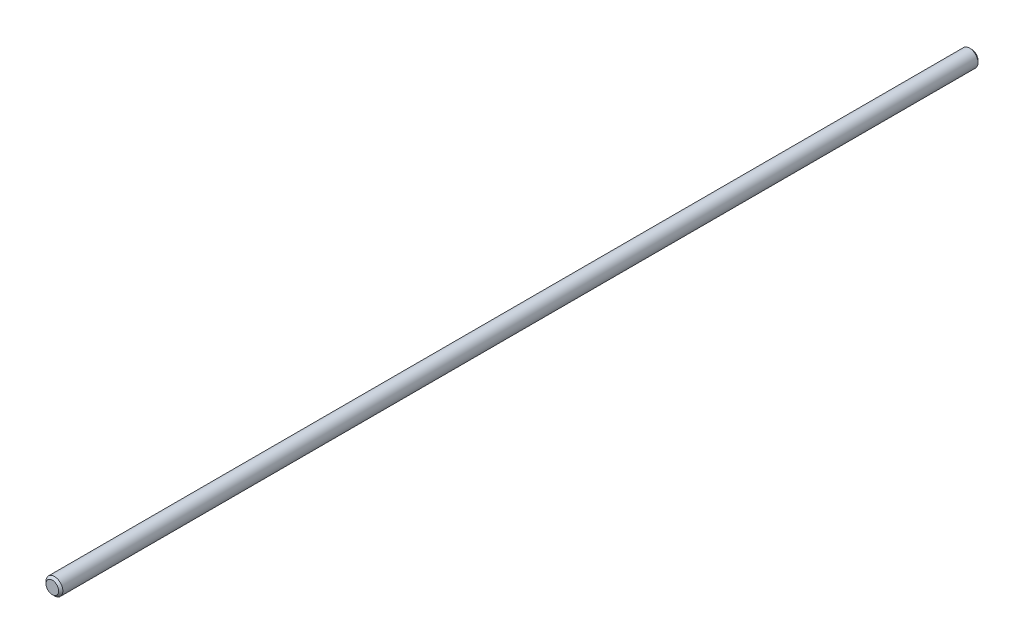
ISO-10303-21;
HEADER;
FILE_DESCRIPTION(('STEP AP214'),'2;1');
FILE_NAME('part.step','',(''),(''),'','','');
FILE_SCHEMA(('AUTOMOTIVE_DESIGN { 1 0 10303 214 1 1 1 1 }'));
ENDSEC;
DATA;
#1=APPLICATION_CONTEXT('core data for automotive mechanical design processes');
#2=APPLICATION_PROTOCOL_DEFINITION('international standard','automotive_design',2000,#1);
#3=PRODUCT_CONTEXT('',#1,'mechanical');
#4=PRODUCT('Part','Part','',(#3));
#5=PRODUCT_RELATED_PRODUCT_CATEGORY('part','',(#4));
#6=PRODUCT_DEFINITION_FORMATION('','',#4);
#7=PRODUCT_DEFINITION_CONTEXT('part definition',#1,'design');
#8=PRODUCT_DEFINITION('design','',#6,#7);
#9=PRODUCT_DEFINITION_SHAPE('','',#8);
#10=(LENGTH_UNIT() NAMED_UNIT(*) SI_UNIT(.MILLI.,.METRE.));
#11=(NAMED_UNIT(*) PLANE_ANGLE_UNIT() SI_UNIT($,.RADIAN.));
#12=(NAMED_UNIT(*) SI_UNIT($,.STERADIAN.) SOLID_ANGLE_UNIT());
#13=UNCERTAINTY_MEASURE_WITH_UNIT(LENGTH_MEASURE(1.E-05),#10,'distance_accuracy_value','');
#14=(GEOMETRIC_REPRESENTATION_CONTEXT(3) GLOBAL_UNCERTAINTY_ASSIGNED_CONTEXT((#13)) GLOBAL_UNIT_ASSIGNED_CONTEXT((#10,
#11,#12)) REPRESENTATION_CONTEXT('',''));
#15=CARTESIAN_POINT('',(0.,0.,0.));
#16=DIRECTION('',(0.,0.,1.));
#17=DIRECTION('',(1.,0.,0.));
#18=AXIS2_PLACEMENT_3D('',#15,#16,#17);
#19=CARTESIAN_POINT('',(0.,0.,437.));
#20=DIRECTION('',(0.,0.,-1.));
#21=DIRECTION('',(-1.,0.,0.));
#22=AXIS2_PLACEMENT_3D('',#19,#20,#21);
#23=CYLINDRICAL_SURFACE('',#22,4.);
#24=CARTESIAN_POINT('',(0.,0.,436.));
#25=DIRECTION('',(0.,0.,1.));
#26=DIRECTION('',(1.,0.,0.));
#27=AXIS2_PLACEMENT_3D('',#24,#25,#26);
#28=CIRCLE('',#27,4.);
#29=CARTESIAN_POINT('',(4.,0.,436.));
#30=VERTEX_POINT('',#29);
#31=EDGE_CURVE('E38',#30,#30,#28,.F.);
#32=ORIENTED_EDGE('',*,*,#31,.T.);
#33=EDGE_LOOP('',(#32));
#34=FACE_BOUND('',#33,.T.);
#35=CARTESIAN_POINT('',(0.,0.,1.00000000000006));
#36=DIRECTION('',(0.,0.,1.));
#37=DIRECTION('',(1.,0.,0.));
#38=AXIS2_PLACEMENT_3D('',#35,#36,#37);
#39=CIRCLE('',#38,4.);
#40=CARTESIAN_POINT('',(4.,0.,1.00000000000006));
#41=VERTEX_POINT('',#40);
#42=EDGE_CURVE('E42',#41,#41,#39,.T.);
#43=ORIENTED_EDGE('',*,*,#42,.T.);
#44=EDGE_LOOP('',(#43));
#45=FACE_BOUND('',#44,.T.);
#46=ADVANCED_FACE('F31',(#34,#45),#23,.T.);
#47=CARTESIAN_POINT('',(0.,0.,437.));
#48=DIRECTION('',(0.,0.,1.));
#49=DIRECTION('',(1.,0.,0.));
#50=AXIS2_PLACEMENT_3D('',#47,#48,#49);
#51=PLANE('',#50);
#52=CARTESIAN_POINT('',(0.,0.,437.));
#53=DIRECTION('',(0.,0.,1.));
#54=DIRECTION('',(1.,0.,0.));
#55=AXIS2_PLACEMENT_3D('',#52,#53,#54);
#56=CIRCLE('',#55,2.99999999999995);
#57=CARTESIAN_POINT('',(2.99999999999995,0.,437.));
#58=VERTEX_POINT('',#57);
#59=EDGE_CURVE('E46',#58,#58,#56,.T.);
#60=ORIENTED_EDGE('',*,*,#59,.T.);
#61=EDGE_LOOP('',(#60));
#62=FACE_BOUND('',#61,.T.);
#63=ADVANCED_FACE('F52',(#62),#51,.T.);
#64=CARTESIAN_POINT('',(0.,0.,0.));
#65=DIRECTION('',(0.,0.,1.));
#66=DIRECTION('',(1.,0.,0.));
#67=AXIS2_PLACEMENT_3D('',#64,#65,#66);
#68=PLANE('',#67);
#69=CARTESIAN_POINT('',(0.,0.,0.));
#70=DIRECTION('',(0.,0.,1.));
#71=DIRECTION('',(1.,0.,0.));
#72=AXIS2_PLACEMENT_3D('',#69,#70,#71);
#73=CIRCLE('',#72,3.);
#74=CARTESIAN_POINT('',(3.,0.,0.));
#75=VERTEX_POINT('',#74);
#76=EDGE_CURVE('E10',#75,#75,#73,.F.);
#77=ORIENTED_EDGE('',*,*,#76,.T.);
#78=EDGE_LOOP('',(#77));
#79=FACE_BOUND('',#78,.T.);
#80=ADVANCED_FACE('F56',(#79),#68,.F.);
#81=CARTESIAN_POINT('',(0.,0.,437.));
#82=DIRECTION('',(0.,0.,-1.));
#83=DIRECTION('',(-1.,0.,0.));
#84=AXIS2_PLACEMENT_3D('',#81,#82,#83);
#85=CONICAL_SURFACE('',#84,2.99999999999995,0.785398163397474);
#86=ORIENTED_EDGE('',*,*,#31,.F.);
#87=EDGE_LOOP('',(#86));
#88=FACE_BOUND('',#87,.T.);
#89=ORIENTED_EDGE('',*,*,#59,.F.);
#90=EDGE_LOOP('',(#89));
#91=FACE_BOUND('',#90,.T.);
#92=ADVANCED_FACE('F54',(#88,#91),#85,.T.);
#93=CARTESIAN_POINT('',(0.,0.,1.00000000000006));
#94=DIRECTION('',(0.,0.,1.));
#95=DIRECTION('',(1.,0.,0.));
#96=AXIS2_PLACEMENT_3D('',#93,#94,#95);
#97=CONICAL_SURFACE('',#96,4.,0.785398163397419);
#98=ORIENTED_EDGE('',*,*,#76,.F.);
#99=EDGE_LOOP('',(#98));
#100=FACE_BOUND('',#99,.T.);
#101=ORIENTED_EDGE('',*,*,#42,.F.);
#102=EDGE_LOOP('',(#101));
#103=FACE_BOUND('',#102,.T.);
#104=ADVANCED_FACE('F33',(#100,#103),#97,.T.);
#105=CLOSED_SHELL('',(#46,#63,#80,#92,#104));
#106=MANIFOLD_SOLID_BREP('B2',#105);
#107=ADVANCED_BREP_SHAPE_REPRESENTATION('',(#18,#106),#14);
#108=SHAPE_DEFINITION_REPRESENTATION(#9,#107);
ENDSEC;
END-ISO-10303-21;
